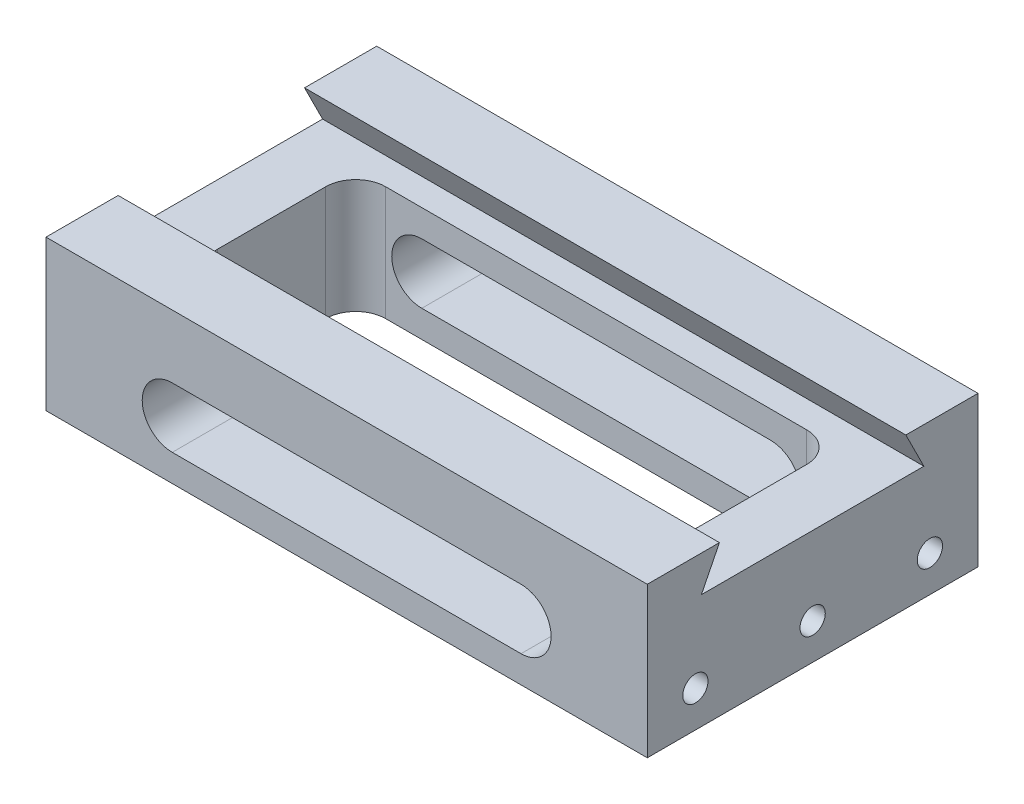
ISO-10303-21;
HEADER;
FILE_DESCRIPTION(('STEP AP214'),'2;1');
FILE_NAME('part.step','',(''),(''),'','','');
FILE_SCHEMA(('AUTOMOTIVE_DESIGN { 1 0 10303 214 1 1 1 1 }'));
ENDSEC;
DATA;
#1=APPLICATION_CONTEXT('core data for automotive mechanical design processes');
#2=APPLICATION_PROTOCOL_DEFINITION('international standard','automotive_design',2000,#1);
#3=PRODUCT_CONTEXT('',#1,'mechanical');
#4=PRODUCT('Part','Part','',(#3));
#5=PRODUCT_RELATED_PRODUCT_CATEGORY('part','',(#4));
#6=PRODUCT_DEFINITION_FORMATION('','',#4);
#7=PRODUCT_DEFINITION_CONTEXT('part definition',#1,'design');
#8=PRODUCT_DEFINITION('design','',#6,#7);
#9=PRODUCT_DEFINITION_SHAPE('','',#8);
#10=(LENGTH_UNIT() NAMED_UNIT(*) SI_UNIT(.MILLI.,.METRE.));
#11=(NAMED_UNIT(*) PLANE_ANGLE_UNIT() SI_UNIT($,.RADIAN.));
#12=(NAMED_UNIT(*) SI_UNIT($,.STERADIAN.) SOLID_ANGLE_UNIT());
#13=UNCERTAINTY_MEASURE_WITH_UNIT(LENGTH_MEASURE(1.E-05),#10,'distance_accuracy_value','');
#14=(GEOMETRIC_REPRESENTATION_CONTEXT(3) GLOBAL_UNCERTAINTY_ASSIGNED_CONTEXT((#13)) GLOBAL_UNIT_ASSIGNED_CONTEXT((#10,
#11,#12)) REPRESENTATION_CONTEXT('',''));
#15=CARTESIAN_POINT('',(0.,0.,0.));
#16=DIRECTION('',(0.,0.,1.));
#17=DIRECTION('',(1.,0.,0.));
#18=AXIS2_PLACEMENT_3D('',#15,#16,#17);
#19=CARTESIAN_POINT('',(0.,25.,0.));
#20=DIRECTION('',(0.,-1.,0.));
#21=DIRECTION('',(0.,0.,-1.));
#22=AXIS2_PLACEMENT_3D('',#19,#20,#21);
#23=PLANE('',#22);
#24=DIRECTION('',(0.,0.,1.));
#25=VECTOR('',#24,1.);
#26=CARTESIAN_POINT('',(-50.,25.,27.5));
#27=LINE('',#26,#25);
#28=CARTESIAN_POINT('',(-50.,25.,-27.5));
#29=VERTEX_POINT('',#28);
#30=CARTESIAN_POINT('',(-50.,25.,-15.5));
#31=VERTEX_POINT('',#30);
#32=EDGE_CURVE('E423',#29,#31,#27,.T.);
#33=ORIENTED_EDGE('',*,*,#32,.T.);
#34=DIRECTION('',(1.,0.,0.));
#35=VECTOR('',#34,1.);
#36=CARTESIAN_POINT('',(-50.,25.,-15.5));
#37=LINE('',#36,#35);
#38=CARTESIAN_POINT('',(50.,25.,-15.5));
#39=VERTEX_POINT('',#38);
#40=EDGE_CURVE('E338',#31,#39,#37,.T.);
#41=ORIENTED_EDGE('',*,*,#40,.T.);
#42=DIRECTION('',(0.,0.,-1.));
#43=VECTOR('',#42,1.);
#44=CARTESIAN_POINT('',(50.,25.,27.5));
#45=LINE('',#44,#43);
#46=CARTESIAN_POINT('',(50.,25.,-27.5));
#47=VERTEX_POINT('',#46);
#48=EDGE_CURVE('E420',#39,#47,#45,.T.);
#49=ORIENTED_EDGE('',*,*,#48,.T.);
#50=DIRECTION('',(-1.,0.,0.));
#51=VECTOR('',#50,1.);
#52=CARTESIAN_POINT('',(-50.,25.,-27.5));
#53=LINE('',#52,#51);
#54=EDGE_CURVE('E419',#47,#29,#53,.T.);
#55=ORIENTED_EDGE('',*,*,#54,.T.);
#56=EDGE_LOOP('',(#33,#41,#49,#55));
#57=FACE_BOUND('',#56,.T.);
#58=ADVANCED_FACE('F50',(#57),#23,.F.);
#59=CARTESIAN_POINT('',(50.,25.,27.5));
#60=DIRECTION('',(-1.,0.,0.));
#61=DIRECTION('',(0.,0.,1.));
#62=AXIS2_PLACEMENT_3D('',#59,#60,#61);
#63=PLANE('',#62);
#64=CARTESIAN_POINT('',(50.,6.,19.5));
#65=DIRECTION('',(1.,0.,0.));
#66=DIRECTION('',(0.,0.,-1.));
#67=AXIS2_PLACEMENT_3D('',#64,#65,#66);
#68=CIRCLE('',#67,2.1);
#69=CARTESIAN_POINT('',(50.,6.,17.4));
#70=VERTEX_POINT('',#69);
#71=EDGE_CURVE('E256',#70,#70,#68,.T.);
#72=ORIENTED_EDGE('',*,*,#71,.F.);
#73=EDGE_LOOP('',(#72));
#74=FACE_BOUND('',#73,.T.);
#75=CARTESIAN_POINT('',(50.,6.,0.));
#76=DIRECTION('',(1.,0.,0.));
#77=DIRECTION('',(0.,0.,-1.));
#78=AXIS2_PLACEMENT_3D('',#75,#76,#77);
#79=CIRCLE('',#78,2.1);
#80=CARTESIAN_POINT('',(50.,6.,-2.1));
#81=VERTEX_POINT('',#80);
#82=EDGE_CURVE('E262',#81,#81,#79,.T.);
#83=ORIENTED_EDGE('',*,*,#82,.F.);
#84=EDGE_LOOP('',(#83));
#85=FACE_BOUND('',#84,.T.);
#86=CARTESIAN_POINT('',(50.,6.,-19.5));
#87=DIRECTION('',(1.,0.,0.));
#88=DIRECTION('',(0.,0.,-1.));
#89=AXIS2_PLACEMENT_3D('',#86,#87,#88);
#90=CIRCLE('',#89,2.1);
#91=CARTESIAN_POINT('',(50.,6.,-21.6));
#92=VERTEX_POINT('',#91);
#93=EDGE_CURVE('E268',#92,#92,#90,.T.);
#94=ORIENTED_EDGE('',*,*,#93,.F.);
#95=EDGE_LOOP('',(#94));
#96=FACE_BOUND('',#95,.T.);
#97=ORIENTED_EDGE('',*,*,#48,.F.);
#98=DIRECTION('',(0.,0.894427190999916,0.447213595499958));
#99=VECTOR('',#98,1.);
#100=CARTESIAN_POINT('',(50.,25.,-15.5));
#101=LINE('',#100,#99);
#102=CARTESIAN_POINT('',(50.,19.,-18.5));
#103=VERTEX_POINT('',#102);
#104=EDGE_CURVE('E325',#103,#39,#101,.T.);
#105=ORIENTED_EDGE('',*,*,#104,.F.);
#106=DIRECTION('',(0.,0.,-1.));
#107=VECTOR('',#106,1.);
#108=CARTESIAN_POINT('',(50.,19.,-18.5));
#109=LINE('',#108,#107);
#110=CARTESIAN_POINT('',(50.,19.,18.5));
#111=VERTEX_POINT('',#110);
#112=EDGE_CURVE('E334',#111,#103,#109,.T.);
#113=ORIENTED_EDGE('',*,*,#112,.F.);
#114=DIRECTION('',(0.,-0.894427190999916,0.447213595499958));
#115=VECTOR('',#114,1.);
#116=CARTESIAN_POINT('',(50.,25.,15.5));
#117=LINE('',#116,#115);
#118=CARTESIAN_POINT('',(50.,25.,15.5));
#119=VERTEX_POINT('',#118);
#120=EDGE_CURVE('E320',#119,#111,#117,.T.);
#121=ORIENTED_EDGE('',*,*,#120,.F.);
#122=CARTESIAN_POINT('',(50.,25.,27.5));
#123=VERTEX_POINT('',#122);
#124=EDGE_CURVE('E416',#123,#119,#45,.T.);
#125=ORIENTED_EDGE('',*,*,#124,.F.);
#126=DIRECTION('',(0.,-1.,0.));
#127=VECTOR('',#126,1.);
#128=CARTESIAN_POINT('',(50.,25.,27.5));
#129=LINE('',#128,#127);
#130=CARTESIAN_POINT('',(50.,0.,27.5));
#131=VERTEX_POINT('',#130);
#132=EDGE_CURVE('E428',#123,#131,#129,.T.);
#133=ORIENTED_EDGE('',*,*,#132,.T.);
#134=DIRECTION('',(0.,0.,-1.));
#135=VECTOR('',#134,1.);
#136=CARTESIAN_POINT('',(50.,0.,27.5));
#137=LINE('',#136,#135);
#138=CARTESIAN_POINT('',(50.,0.,-27.5));
#139=VERTEX_POINT('',#138);
#140=EDGE_CURVE('E395',#131,#139,#137,.T.);
#141=ORIENTED_EDGE('',*,*,#140,.T.);
#142=DIRECTION('',(0.,-1.,0.));
#143=VECTOR('',#142,1.);
#144=CARTESIAN_POINT('',(50.,25.,-27.5));
#145=LINE('',#144,#143);
#146=EDGE_CURVE('E445',#47,#139,#145,.T.);
#147=ORIENTED_EDGE('',*,*,#146,.F.);
#148=EDGE_LOOP('',(#97,#105,#113,#121,#125,#133,#141,#147));
#149=FACE_BOUND('',#148,.T.);
#150=ADVANCED_FACE('F52',(#74,#85,#96,#149),#63,.F.);
#151=CARTESIAN_POINT('',(-50.,25.,-27.5));
#152=DIRECTION('',(0.,0.,1.));
#153=DIRECTION('',(1.,0.,0.));
#154=AXIS2_PLACEMENT_3D('',#151,#152,#153);
#155=PLANE('',#154);
#156=DIRECTION('',(-1.,0.,0.));
#157=VECTOR('',#156,1.);
#158=CARTESIAN_POINT('',(-29.,14.5,-27.5));
#159=LINE('',#158,#157);
#160=CARTESIAN_POINT('',(29.,14.5,-27.5));
#161=VERTEX_POINT('',#160);
#162=CARTESIAN_POINT('',(-29.,14.5,-27.5));
#163=VERTEX_POINT('',#162);
#164=EDGE_CURVE('E282',#161,#163,#159,.T.);
#165=ORIENTED_EDGE('',*,*,#164,.T.);
#166=CARTESIAN_POINT('',(-29.,9.5,-27.5));
#167=DIRECTION('',(0.,0.,1.));
#168=DIRECTION('',(1.,0.,0.));
#169=AXIS2_PLACEMENT_3D('',#166,#167,#168);
#170=CIRCLE('',#169,5.00000000000001);
#171=CARTESIAN_POINT('',(-29.,4.49999999999999,-27.5));
#172=VERTEX_POINT('',#171);
#173=EDGE_CURVE('E274',#163,#172,#170,.T.);
#174=ORIENTED_EDGE('',*,*,#173,.T.);
#175=DIRECTION('',(1.,0.,0.));
#176=VECTOR('',#175,1.);
#177=CARTESIAN_POINT('',(-29.,4.49999999999999,-27.5));
#178=LINE('',#177,#176);
#179=CARTESIAN_POINT('',(29.,4.49999999999999,-27.5));
#180=VERTEX_POINT('',#179);
#181=EDGE_CURVE('E277',#172,#180,#178,.T.);
#182=ORIENTED_EDGE('',*,*,#181,.T.);
#183=CARTESIAN_POINT('',(29.,9.50000000000001,-27.5));
#184=DIRECTION('',(0.,0.,1.));
#185=DIRECTION('',(1.,0.,0.));
#186=AXIS2_PLACEMENT_3D('',#183,#184,#185);
#187=CIRCLE('',#186,5.00000000000002);
#188=EDGE_CURVE('E65',#180,#161,#187,.T.);
#189=ORIENTED_EDGE('',*,*,#188,.T.);
#190=EDGE_LOOP('',(#165,#174,#182,#189));
#191=FACE_BOUND('',#190,.T.);
#192=DIRECTION('',(-1.,0.,0.));
#193=VECTOR('',#192,1.);
#194=CARTESIAN_POINT('',(-50.,0.,-27.5));
#195=LINE('',#194,#193);
#196=CARTESIAN_POINT('',(-50.,0.,-27.5));
#197=VERTEX_POINT('',#196);
#198=EDGE_CURVE('E431',#139,#197,#195,.T.);
#199=ORIENTED_EDGE('',*,*,#198,.T.);
#200=DIRECTION('',(0.,-1.,0.));
#201=VECTOR('',#200,1.);
#202=CARTESIAN_POINT('',(-50.,25.,-27.5));
#203=LINE('',#202,#201);
#204=EDGE_CURVE('E442',#29,#197,#203,.T.);
#205=ORIENTED_EDGE('',*,*,#204,.F.);
#206=ORIENTED_EDGE('',*,*,#54,.F.);
#207=ORIENTED_EDGE('',*,*,#146,.T.);
#208=EDGE_LOOP('',(#199,#205,#206,#207));
#209=FACE_BOUND('',#208,.T.);
#210=ADVANCED_FACE('F495',(#191,#209),#155,.F.);
#211=CARTESIAN_POINT('',(-50.,25.,27.5));
#212=DIRECTION('',(1.,0.,0.));
#213=DIRECTION('',(0.,0.,-1.));
#214=AXIS2_PLACEMENT_3D('',#211,#212,#213);
#215=PLANE('',#214);
#216=CARTESIAN_POINT('',(-50.,6.,19.5));
#217=DIRECTION('',(-1.,0.,0.));
#218=DIRECTION('',(0.,0.,1.));
#219=AXIS2_PLACEMENT_3D('',#216,#217,#218);
#220=CIRCLE('',#219,2.1);
#221=CARTESIAN_POINT('',(-50.,6.,21.6));
#222=VERTEX_POINT('',#221);
#223=EDGE_CURVE('E240',#222,#222,#220,.T.);
#224=ORIENTED_EDGE('',*,*,#223,.F.);
#225=EDGE_LOOP('',(#224));
#226=FACE_BOUND('',#225,.T.);
#227=CARTESIAN_POINT('',(-50.,6.,0.));
#228=DIRECTION('',(-1.,0.,0.));
#229=DIRECTION('',(0.,0.,1.));
#230=AXIS2_PLACEMENT_3D('',#227,#228,#229);
#231=CIRCLE('',#230,2.1);
#232=CARTESIAN_POINT('',(-50.,6.,2.1));
#233=VERTEX_POINT('',#232);
#234=EDGE_CURVE('E239',#233,#233,#231,.T.);
#235=ORIENTED_EDGE('',*,*,#234,.F.);
#236=EDGE_LOOP('',(#235));
#237=FACE_BOUND('',#236,.T.);
#238=CARTESIAN_POINT('',(-50.,6.,-19.5));
#239=DIRECTION('',(-1.,0.,0.));
#240=DIRECTION('',(0.,0.,1.));
#241=AXIS2_PLACEMENT_3D('',#238,#239,#240);
#242=CIRCLE('',#241,2.1);
#243=CARTESIAN_POINT('',(-50.,6.,-17.4));
#244=VERTEX_POINT('',#243);
#245=EDGE_CURVE('E250',#244,#244,#242,.T.);
#246=ORIENTED_EDGE('',*,*,#245,.F.);
#247=EDGE_LOOP('',(#246));
#248=FACE_BOUND('',#247,.T.);
#249=DIRECTION('',(0.,0.,-1.));
#250=VECTOR('',#249,1.);
#251=CARTESIAN_POINT('',(-50.,19.,-18.5));
#252=LINE('',#251,#250);
#253=CARTESIAN_POINT('',(-50.,19.,18.5));
#254=VERTEX_POINT('',#253);
#255=CARTESIAN_POINT('',(-50.,19.,-18.5));
#256=VERTEX_POINT('',#255);
#257=EDGE_CURVE('E324',#254,#256,#252,.T.);
#258=ORIENTED_EDGE('',*,*,#257,.T.);
#259=DIRECTION('',(0.,0.894427190999916,0.447213595499958));
#260=VECTOR('',#259,1.);
#261=CARTESIAN_POINT('',(-50.,25.,-15.5));
#262=LINE('',#261,#260);
#263=EDGE_CURVE('E328',#256,#31,#262,.T.);
#264=ORIENTED_EDGE('',*,*,#263,.T.);
#265=ORIENTED_EDGE('',*,*,#32,.F.);
#266=ORIENTED_EDGE('',*,*,#204,.T.);
#267=DIRECTION('',(0.,0.,1.));
#268=VECTOR('',#267,1.);
#269=CARTESIAN_POINT('',(-50.,0.,27.5));
#270=LINE('',#269,#268);
#271=CARTESIAN_POINT('',(-50.,0.,27.5));
#272=VERTEX_POINT('',#271);
#273=EDGE_CURVE('E433',#197,#272,#270,.T.);
#274=ORIENTED_EDGE('',*,*,#273,.T.);
#275=DIRECTION('',(0.,-1.,0.));
#276=VECTOR('',#275,1.);
#277=CARTESIAN_POINT('',(-50.,25.,27.5));
#278=LINE('',#277,#276);
#279=CARTESIAN_POINT('',(-50.,25.,27.5));
#280=VERTEX_POINT('',#279);
#281=EDGE_CURVE('E439',#280,#272,#278,.T.);
#282=ORIENTED_EDGE('',*,*,#281,.F.);
#283=CARTESIAN_POINT('',(-50.,25.,15.5));
#284=VERTEX_POINT('',#283);
#285=EDGE_CURVE('E422',#284,#280,#27,.T.);
#286=ORIENTED_EDGE('',*,*,#285,.F.);
#287=DIRECTION('',(0.,-0.894427190999916,0.447213595499958));
#288=VECTOR('',#287,1.);
#289=CARTESIAN_POINT('',(-50.,25.,15.5));
#290=LINE('',#289,#288);
#291=EDGE_CURVE('E321',#284,#254,#290,.T.);
#292=ORIENTED_EDGE('',*,*,#291,.T.);
#293=EDGE_LOOP('',(#258,#264,#265,#266,#274,#282,#286,#292));
#294=FACE_BOUND('',#293,.T.);
#295=ADVANCED_FACE('F508',(#226,#237,#248,#294),#215,.F.);
#296=CARTESIAN_POINT('',(-50.,25.,27.5));
#297=DIRECTION('',(0.,0.,-1.));
#298=DIRECTION('',(-1.,0.,0.));
#299=AXIS2_PLACEMENT_3D('',#296,#297,#298);
#300=PLANE('',#299);
#301=DIRECTION('',(1.,0.,0.));
#302=VECTOR('',#301,1.);
#303=CARTESIAN_POINT('',(-29.,4.49999999999999,27.5));
#304=LINE('',#303,#302);
#305=CARTESIAN_POINT('',(-29.,4.49999999999999,27.5));
#306=VERTEX_POINT('',#305);
#307=CARTESIAN_POINT('',(29.,4.49999999999999,27.5));
#308=VERTEX_POINT('',#307);
#309=EDGE_CURVE('E287',#306,#308,#304,.T.);
#310=ORIENTED_EDGE('',*,*,#309,.F.);
#311=CARTESIAN_POINT('',(-29.,9.5,27.5));
#312=DIRECTION('',(0.,0.,1.));
#313=DIRECTION('',(1.,0.,0.));
#314=AXIS2_PLACEMENT_3D('',#311,#312,#313);
#315=CIRCLE('',#314,5.00000000000001);
#316=CARTESIAN_POINT('',(-29.,14.5,27.5));
#317=VERTEX_POINT('',#316);
#318=EDGE_CURVE('E73',#317,#306,#315,.T.);
#319=ORIENTED_EDGE('',*,*,#318,.F.);
#320=DIRECTION('',(-1.,0.,0.));
#321=VECTOR('',#320,1.);
#322=CARTESIAN_POINT('',(-29.,14.5,27.5));
#323=LINE('',#322,#321);
#324=CARTESIAN_POINT('',(29.,14.5,27.5));
#325=VERTEX_POINT('',#324);
#326=EDGE_CURVE('E278',#325,#317,#323,.T.);
#327=ORIENTED_EDGE('',*,*,#326,.F.);
#328=CARTESIAN_POINT('',(29.,9.50000000000001,27.5));
#329=DIRECTION('',(0.,0.,1.));
#330=DIRECTION('',(1.,0.,0.));
#331=AXIS2_PLACEMENT_3D('',#328,#329,#330);
#332=CIRCLE('',#331,5.00000000000002);
#333=EDGE_CURVE('E290',#308,#325,#332,.T.);
#334=ORIENTED_EDGE('',*,*,#333,.F.);
#335=EDGE_LOOP('',(#310,#319,#327,#334));
#336=FACE_BOUND('',#335,.T.);
#337=DIRECTION('',(1.,0.,0.));
#338=VECTOR('',#337,1.);
#339=CARTESIAN_POINT('',(-50.,0.,27.5));
#340=LINE('',#339,#338);
#341=EDGE_CURVE('E435',#272,#131,#340,.T.);
#342=ORIENTED_EDGE('',*,*,#341,.T.);
#343=ORIENTED_EDGE('',*,*,#132,.F.);
#344=DIRECTION('',(1.,0.,0.));
#345=VECTOR('',#344,1.);
#346=CARTESIAN_POINT('',(-50.,25.,27.5));
#347=LINE('',#346,#345);
#348=EDGE_CURVE('E426',#280,#123,#347,.T.);
#349=ORIENTED_EDGE('',*,*,#348,.F.);
#350=ORIENTED_EDGE('',*,*,#281,.T.);
#351=EDGE_LOOP('',(#342,#343,#349,#350));
#352=FACE_BOUND('',#351,.T.);
#353=ADVANCED_FACE('F471',(#336,#352),#300,.F.);
#354=ORIENTED_EDGE('',*,*,#124,.T.);
#355=DIRECTION('',(1.,0.,0.));
#356=VECTOR('',#355,1.);
#357=CARTESIAN_POINT('',(-50.,25.,15.5));
#358=LINE('',#357,#356);
#359=EDGE_CURVE('E331',#284,#119,#358,.T.);
#360=ORIENTED_EDGE('',*,*,#359,.F.);
#361=ORIENTED_EDGE('',*,*,#285,.T.);
#362=ORIENTED_EDGE('',*,*,#348,.T.);
#363=EDGE_LOOP('',(#354,#360,#361,#362));
#364=FACE_BOUND('',#363,.T.);
#365=ADVANCED_FACE('F491',(#364),#23,.F.);
#366=CARTESIAN_POINT('',(0.,0.,0.));
#367=DIRECTION('',(0.,-1.,0.));
#368=DIRECTION('',(0.,0.,-1.));
#369=AXIS2_PLACEMENT_3D('',#366,#367,#368);
#370=PLANE('',#369);
#371=CARTESIAN_POINT('',(-35.,0.,9.));
#372=DIRECTION('',(0.,1.,0.));
#373=DIRECTION('',(0.,0.,-1.));
#374=AXIS2_PLACEMENT_3D('',#371,#372,#373);
#375=CIRCLE('',#374,5.);
#376=CARTESIAN_POINT('',(-40.,0.,8.99999999999996));
#377=VERTEX_POINT('',#376);
#378=CARTESIAN_POINT('',(-35.,0.,14.));
#379=VERTEX_POINT('',#378);
#380=EDGE_CURVE('E367',#377,#379,#375,.T.);
#381=ORIENTED_EDGE('',*,*,#380,.T.);
#382=DIRECTION('',(1.,0.,0.));
#383=VECTOR('',#382,1.);
#384=CARTESIAN_POINT('',(-35.,0.,14.));
#385=LINE('',#384,#383);
#386=CARTESIAN_POINT('',(35.,0.,14.));
#387=VERTEX_POINT('',#386);
#388=EDGE_CURVE('E370',#379,#387,#385,.T.);
#389=ORIENTED_EDGE('',*,*,#388,.T.);
#390=CARTESIAN_POINT('',(35.,0.,9.));
#391=DIRECTION('',(0.,1.,0.));
#392=DIRECTION('',(0.,0.,1.));
#393=AXIS2_PLACEMENT_3D('',#390,#391,#392);
#394=CIRCLE('',#393,5.);
#395=CARTESIAN_POINT('',(40.,0.,8.99999999999997));
#396=VERTEX_POINT('',#395);
#397=EDGE_CURVE('E373',#387,#396,#394,.T.);
#398=ORIENTED_EDGE('',*,*,#397,.T.);
#399=DIRECTION('',(0.,0.,-1.));
#400=VECTOR('',#399,1.);
#401=CARTESIAN_POINT('',(40.,0.,8.99999999999996));
#402=LINE('',#401,#400);
#403=CARTESIAN_POINT('',(40.,0.,-8.99999999999996));
#404=VERTEX_POINT('',#403);
#405=EDGE_CURVE('E376',#396,#404,#402,.T.);
#406=ORIENTED_EDGE('',*,*,#405,.T.);
#407=CARTESIAN_POINT('',(35.,0.,-9.));
#408=DIRECTION('',(0.,1.,0.));
#409=DIRECTION('',(0.,0.,-1.));
#410=AXIS2_PLACEMENT_3D('',#407,#408,#409);
#411=CIRCLE('',#410,5.);
#412=CARTESIAN_POINT('',(35.,0.,-14.));
#413=VERTEX_POINT('',#412);
#414=EDGE_CURVE('E379',#404,#413,#411,.T.);
#415=ORIENTED_EDGE('',*,*,#414,.T.);
#416=DIRECTION('',(-1.,0.,0.));
#417=VECTOR('',#416,1.);
#418=CARTESIAN_POINT('',(-35.,0.,-14.));
#419=LINE('',#418,#417);
#420=CARTESIAN_POINT('',(-35.,0.,-14.));
#421=VERTEX_POINT('',#420);
#422=EDGE_CURVE('E382',#413,#421,#419,.T.);
#423=ORIENTED_EDGE('',*,*,#422,.T.);
#424=CARTESIAN_POINT('',(-35.,0.,-9.));
#425=DIRECTION('',(0.,1.,0.));
#426=DIRECTION('',(0.,0.,-1.));
#427=AXIS2_PLACEMENT_3D('',#424,#425,#426);
#428=CIRCLE('',#427,5.);
#429=CARTESIAN_POINT('',(-40.,0.,-8.99999999999996));
#430=VERTEX_POINT('',#429);
#431=EDGE_CURVE('E385',#421,#430,#428,.T.);
#432=ORIENTED_EDGE('',*,*,#431,.T.);
#433=DIRECTION('',(0.,0.,1.));
#434=VECTOR('',#433,1.);
#435=CARTESIAN_POINT('',(-40.,0.,8.99999999999996));
#436=LINE('',#435,#434);
#437=EDGE_CURVE('E388',#430,#377,#436,.T.);
#438=ORIENTED_EDGE('',*,*,#437,.T.);
#439=EDGE_LOOP('',(#381,#389,#398,#406,#415,#423,#432,#438));
#440=FACE_BOUND('',#439,.T.);
#441=ORIENTED_EDGE('',*,*,#140,.F.);
#442=ORIENTED_EDGE('',*,*,#341,.F.);
#443=ORIENTED_EDGE('',*,*,#273,.F.);
#444=ORIENTED_EDGE('',*,*,#198,.F.);
#445=EDGE_LOOP('',(#441,#442,#443,#444));
#446=FACE_BOUND('',#445,.T.);
#447=ADVANCED_FACE('F500',(#440,#446),#370,.T.);
#448=CARTESIAN_POINT('',(-35.,0.,9.));
#449=DIRECTION('',(0.,1.,0.));
#450=DIRECTION('',(0.,0.,1.));
#451=AXIS2_PLACEMENT_3D('',#448,#449,#450);
#452=CYLINDRICAL_SURFACE('',#451,5.);
#453=DIRECTION('',(0.,1.,0.));
#454=VECTOR('',#453,1.);
#455=CARTESIAN_POINT('',(-40.,0.,8.99999999999996));
#456=LINE('',#455,#454);
#457=CARTESIAN_POINT('',(-40.,19.,8.99999999999996));
#458=VERTEX_POINT('',#457);
#459=EDGE_CURVE('E392',#377,#458,#456,.T.);
#460=ORIENTED_EDGE('',*,*,#459,.T.);
#461=CARTESIAN_POINT('',(-35.,19.,9.));
#462=DIRECTION('',(0.,-1.,0.));
#463=DIRECTION('',(0.,0.,-1.));
#464=AXIS2_PLACEMENT_3D('',#461,#462,#463);
#465=CIRCLE('',#464,5.);
#466=CARTESIAN_POINT('',(-35.,19.,14.));
#467=VERTEX_POINT('',#466);
#468=EDGE_CURVE('E364',#458,#467,#465,.F.);
#469=ORIENTED_EDGE('',*,*,#468,.T.);
#470=DIRECTION('',(0.,1.,0.));
#471=VECTOR('',#470,1.);
#472=CARTESIAN_POINT('',(-35.,0.,14.));
#473=LINE('',#472,#471);
#474=EDGE_CURVE('E391',#379,#467,#473,.T.);
#475=ORIENTED_EDGE('',*,*,#474,.F.);
#476=ORIENTED_EDGE('',*,*,#380,.F.);
#477=EDGE_LOOP('',(#460,#469,#475,#476));
#478=FACE_BOUND('',#477,.T.);
#479=ADVANCED_FACE('F506',(#478),#452,.F.);
#480=CARTESIAN_POINT('',(-40.,0.,8.99999999999996));
#481=DIRECTION('',(-1.,0.,0.));
#482=DIRECTION('',(0.,0.,1.));
#483=AXIS2_PLACEMENT_3D('',#480,#481,#482);
#484=PLANE('',#483);
#485=DIRECTION('',(0.,1.,0.));
#486=VECTOR('',#485,1.);
#487=CARTESIAN_POINT('',(-40.,0.,-8.99999999999996));
#488=LINE('',#487,#486);
#489=CARTESIAN_POINT('',(-40.,19.,-8.99999999999996));
#490=VERTEX_POINT('',#489);
#491=EDGE_CURVE('E396',#430,#490,#488,.T.);
#492=ORIENTED_EDGE('',*,*,#491,.T.);
#493=DIRECTION('',(0.,0.,1.));
#494=VECTOR('',#493,1.);
#495=CARTESIAN_POINT('',(-40.,19.,8.99999999999996));
#496=LINE('',#495,#494);
#497=EDGE_CURVE('E361',#490,#458,#496,.T.);
#498=ORIENTED_EDGE('',*,*,#497,.T.);
#499=ORIENTED_EDGE('',*,*,#459,.F.);
#500=ORIENTED_EDGE('',*,*,#437,.F.);
#501=EDGE_LOOP('',(#492,#498,#499,#500));
#502=FACE_BOUND('',#501,.T.);
#503=ADVANCED_FACE('F547',(#502),#484,.F.);
#504=CARTESIAN_POINT('',(-35.,0.,-9.));
#505=DIRECTION('',(0.,1.,0.));
#506=DIRECTION('',(0.,0.,1.));
#507=AXIS2_PLACEMENT_3D('',#504,#505,#506);
#508=CYLINDRICAL_SURFACE('',#507,5.);
#509=DIRECTION('',(0.,1.,0.));
#510=VECTOR('',#509,1.);
#511=CARTESIAN_POINT('',(-35.,0.,-14.));
#512=LINE('',#511,#510);
#513=CARTESIAN_POINT('',(-35.,19.,-14.));
#514=VERTEX_POINT('',#513);
#515=EDGE_CURVE('E399',#421,#514,#512,.T.);
#516=ORIENTED_EDGE('',*,*,#515,.T.);
#517=CARTESIAN_POINT('',(-35.,19.,-9.));
#518=DIRECTION('',(0.,-1.,0.));
#519=DIRECTION('',(0.,0.,-1.));
#520=AXIS2_PLACEMENT_3D('',#517,#518,#519);
#521=CIRCLE('',#520,5.);
#522=EDGE_CURVE('E358',#514,#490,#521,.F.);
#523=ORIENTED_EDGE('',*,*,#522,.T.);
#524=ORIENTED_EDGE('',*,*,#491,.F.);
#525=ORIENTED_EDGE('',*,*,#431,.F.);
#526=EDGE_LOOP('',(#516,#523,#524,#525));
#527=FACE_BOUND('',#526,.T.);
#528=ADVANCED_FACE('F544',(#527),#508,.F.);
#529=CARTESIAN_POINT('',(-35.,0.,-14.));
#530=DIRECTION('',(0.,0.,-1.));
#531=DIRECTION('',(-1.,0.,0.));
#532=AXIS2_PLACEMENT_3D('',#529,#530,#531);
#533=PLANE('',#532);
#534=DIRECTION('',(-1.,0.,0.));
#535=VECTOR('',#534,1.);
#536=CARTESIAN_POINT('',(-35.,4.49999999999999,-14.));
#537=LINE('',#536,#535);
#538=CARTESIAN_POINT('',(29.,4.49999999999999,-14.));
#539=VERTEX_POINT('',#538);
#540=CARTESIAN_POINT('',(-29.,4.49999999999999,-14.));
#541=VERTEX_POINT('',#540);
#542=EDGE_CURVE('E298',#539,#541,#537,.T.);
#543=ORIENTED_EDGE('',*,*,#542,.T.);
#544=CARTESIAN_POINT('',(-29.,9.5,-14.));
#545=DIRECTION('',(0.,0.,-1.));
#546=DIRECTION('',(-1.,0.,0.));
#547=AXIS2_PLACEMENT_3D('',#544,#545,#546);
#548=CIRCLE('',#547,5.00000000000001);
#549=CARTESIAN_POINT('',(-29.,14.5,-14.));
#550=VERTEX_POINT('',#549);
#551=EDGE_CURVE('E317',#541,#550,#548,.T.);
#552=ORIENTED_EDGE('',*,*,#551,.T.);
#553=DIRECTION('',(1.,0.,0.));
#554=VECTOR('',#553,1.);
#555=CARTESIAN_POINT('',(-35.,14.5,-14.));
#556=LINE('',#555,#554);
#557=CARTESIAN_POINT('',(29.,14.5,-14.));
#558=VERTEX_POINT('',#557);
#559=EDGE_CURVE('E314',#550,#558,#556,.T.);
#560=ORIENTED_EDGE('',*,*,#559,.T.);
#561=CARTESIAN_POINT('',(29.,9.50000000000001,-14.));
#562=DIRECTION('',(0.,0.,-1.));
#563=DIRECTION('',(-1.,0.,0.));
#564=AXIS2_PLACEMENT_3D('',#561,#562,#563);
#565=CIRCLE('',#564,5.00000000000002);
#566=EDGE_CURVE('E311',#558,#539,#565,.T.);
#567=ORIENTED_EDGE('',*,*,#566,.T.);
#568=EDGE_LOOP('',(#543,#552,#560,#567));
#569=FACE_BOUND('',#568,.T.);
#570=DIRECTION('',(0.,1.,0.));
#571=VECTOR('',#570,1.);
#572=CARTESIAN_POINT('',(35.,0.,-14.));
#573=LINE('',#572,#571);
#574=CARTESIAN_POINT('',(35.,19.,-14.));
#575=VERTEX_POINT('',#574);
#576=EDGE_CURVE('E402',#413,#575,#573,.T.);
#577=ORIENTED_EDGE('',*,*,#576,.T.);
#578=DIRECTION('',(-1.,0.,0.));
#579=VECTOR('',#578,1.);
#580=CARTESIAN_POINT('',(-35.,19.,-14.));
#581=LINE('',#580,#579);
#582=EDGE_CURVE('E355',#575,#514,#581,.T.);
#583=ORIENTED_EDGE('',*,*,#582,.T.);
#584=ORIENTED_EDGE('',*,*,#515,.F.);
#585=ORIENTED_EDGE('',*,*,#422,.F.);
#586=EDGE_LOOP('',(#577,#583,#584,#585));
#587=FACE_BOUND('',#586,.T.);
#588=ADVANCED_FACE('F552',(#569,#587),#533,.F.);
#589=CARTESIAN_POINT('',(35.,0.,-9.));
#590=DIRECTION('',(0.,1.,0.));
#591=DIRECTION('',(0.,0.,1.));
#592=AXIS2_PLACEMENT_3D('',#589,#590,#591);
#593=CYLINDRICAL_SURFACE('',#592,5.);
#594=DIRECTION('',(0.,1.,0.));
#595=VECTOR('',#594,1.);
#596=CARTESIAN_POINT('',(40.,0.,-8.99999999999996));
#597=LINE('',#596,#595);
#598=CARTESIAN_POINT('',(40.,19.,-8.99999999999996));
#599=VERTEX_POINT('',#598);
#600=EDGE_CURVE('E405',#404,#599,#597,.T.);
#601=ORIENTED_EDGE('',*,*,#600,.T.);
#602=CARTESIAN_POINT('',(35.,19.,-9.));
#603=DIRECTION('',(0.,-1.,0.));
#604=DIRECTION('',(0.,0.,-1.));
#605=AXIS2_PLACEMENT_3D('',#602,#603,#604);
#606=CIRCLE('',#605,5.);
#607=EDGE_CURVE('E352',#599,#575,#606,.F.);
#608=ORIENTED_EDGE('',*,*,#607,.T.);
#609=ORIENTED_EDGE('',*,*,#576,.F.);
#610=ORIENTED_EDGE('',*,*,#414,.F.);
#611=EDGE_LOOP('',(#601,#608,#609,#610));
#612=FACE_BOUND('',#611,.T.);
#613=ADVANCED_FACE('F554',(#612),#593,.F.);
#614=CARTESIAN_POINT('',(40.,0.,8.99999999999996));
#615=DIRECTION('',(1.,0.,0.));
#616=DIRECTION('',(0.,0.,-1.));
#617=AXIS2_PLACEMENT_3D('',#614,#615,#616);
#618=PLANE('',#617);
#619=DIRECTION('',(0.,1.,0.));
#620=VECTOR('',#619,1.);
#621=CARTESIAN_POINT('',(40.,0.,8.99999999999997));
#622=LINE('',#621,#620);
#623=CARTESIAN_POINT('',(40.,19.,8.99999999999997));
#624=VERTEX_POINT('',#623);
#625=EDGE_CURVE('E408',#396,#624,#622,.T.);
#626=ORIENTED_EDGE('',*,*,#625,.T.);
#627=DIRECTION('',(0.,0.,-1.));
#628=VECTOR('',#627,1.);
#629=CARTESIAN_POINT('',(40.,19.,8.99999999999996));
#630=LINE('',#629,#628);
#631=EDGE_CURVE('E349',#624,#599,#630,.T.);
#632=ORIENTED_EDGE('',*,*,#631,.T.);
#633=ORIENTED_EDGE('',*,*,#600,.F.);
#634=ORIENTED_EDGE('',*,*,#405,.F.);
#635=EDGE_LOOP('',(#626,#632,#633,#634));
#636=FACE_BOUND('',#635,.T.);
#637=ADVANCED_FACE('F557',(#636),#618,.F.);
#638=CARTESIAN_POINT('',(35.,0.,9.));
#639=DIRECTION('',(0.,1.,0.));
#640=DIRECTION('',(0.,0.,1.));
#641=AXIS2_PLACEMENT_3D('',#638,#639,#640);
#642=CYLINDRICAL_SURFACE('',#641,5.);
#643=DIRECTION('',(0.,1.,0.));
#644=VECTOR('',#643,1.);
#645=CARTESIAN_POINT('',(35.,0.,14.));
#646=LINE('',#645,#644);
#647=CARTESIAN_POINT('',(35.,19.,14.));
#648=VERTEX_POINT('',#647);
#649=EDGE_CURVE('E411',#387,#648,#646,.T.);
#650=ORIENTED_EDGE('',*,*,#649,.T.);
#651=CARTESIAN_POINT('',(35.,19.,9.));
#652=DIRECTION('',(0.,-1.,0.));
#653=DIRECTION('',(0.,0.,-1.));
#654=AXIS2_PLACEMENT_3D('',#651,#652,#653);
#655=CIRCLE('',#654,5.);
#656=EDGE_CURVE('E341',#648,#624,#655,.F.);
#657=ORIENTED_EDGE('',*,*,#656,.T.);
#658=ORIENTED_EDGE('',*,*,#625,.F.);
#659=ORIENTED_EDGE('',*,*,#397,.F.);
#660=EDGE_LOOP('',(#650,#657,#658,#659));
#661=FACE_BOUND('',#660,.T.);
#662=ADVANCED_FACE('F559',(#661),#642,.F.);
#663=CARTESIAN_POINT('',(-35.,0.,14.));
#664=DIRECTION('',(0.,0.,1.));
#665=DIRECTION('',(1.,0.,0.));
#666=AXIS2_PLACEMENT_3D('',#663,#664,#665);
#667=PLANE('',#666);
#668=DIRECTION('',(-1.,0.,0.));
#669=VECTOR('',#668,1.);
#670=CARTESIAN_POINT('',(-35.,14.5,14.));
#671=LINE('',#670,#669);
#672=CARTESIAN_POINT('',(29.,14.5,14.));
#673=VERTEX_POINT('',#672);
#674=CARTESIAN_POINT('',(-29.,14.5,14.));
#675=VERTEX_POINT('',#674);
#676=EDGE_CURVE('E58',#673,#675,#671,.T.);
#677=ORIENTED_EDGE('',*,*,#676,.T.);
#678=CARTESIAN_POINT('',(-29.,9.5,14.));
#679=DIRECTION('',(0.,0.,1.));
#680=DIRECTION('',(1.,0.,0.));
#681=AXIS2_PLACEMENT_3D('',#678,#679,#680);
#682=CIRCLE('',#681,5.00000000000001);
#683=CARTESIAN_POINT('',(-29.,4.49999999999999,14.));
#684=VERTEX_POINT('',#683);
#685=EDGE_CURVE('E13',#675,#684,#682,.T.);
#686=ORIENTED_EDGE('',*,*,#685,.T.);
#687=DIRECTION('',(1.,0.,0.));
#688=VECTOR('',#687,1.);
#689=CARTESIAN_POINT('',(-35.,4.49999999999999,14.));
#690=LINE('',#689,#688);
#691=CARTESIAN_POINT('',(29.,4.49999999999999,14.));
#692=VERTEX_POINT('',#691);
#693=EDGE_CURVE('E451',#684,#692,#690,.T.);
#694=ORIENTED_EDGE('',*,*,#693,.T.);
#695=CARTESIAN_POINT('',(29.,9.50000000000001,14.));
#696=DIRECTION('',(0.,0.,1.));
#697=DIRECTION('',(1.,0.,0.));
#698=AXIS2_PLACEMENT_3D('',#695,#696,#697);
#699=CIRCLE('',#698,5.00000000000002);
#700=EDGE_CURVE('E454',#692,#673,#699,.T.);
#701=ORIENTED_EDGE('',*,*,#700,.T.);
#702=EDGE_LOOP('',(#677,#686,#694,#701));
#703=FACE_BOUND('',#702,.T.);
#704=ORIENTED_EDGE('',*,*,#474,.T.);
#705=DIRECTION('',(1.,0.,0.));
#706=VECTOR('',#705,1.);
#707=CARTESIAN_POINT('',(-35.,19.,14.));
#708=LINE('',#707,#706);
#709=EDGE_CURVE('E448',#467,#648,#708,.T.);
#710=ORIENTED_EDGE('',*,*,#709,.T.);
#711=ORIENTED_EDGE('',*,*,#649,.F.);
#712=ORIENTED_EDGE('',*,*,#388,.F.);
#713=EDGE_LOOP('',(#704,#710,#711,#712));
#714=FACE_BOUND('',#713,.T.);
#715=ADVANCED_FACE('F458',(#703,#714),#667,.F.);
#716=CARTESIAN_POINT('',(-50.,19.,-18.5));
#717=DIRECTION('',(0.,-1.,0.));
#718=DIRECTION('',(0.,0.,-1.));
#719=AXIS2_PLACEMENT_3D('',#716,#717,#718);
#720=PLANE('',#719);
#721=ORIENTED_EDGE('',*,*,#112,.T.);
#722=DIRECTION('',(1.,0.,0.));
#723=VECTOR('',#722,1.);
#724=CARTESIAN_POINT('',(-50.,19.,-18.5));
#725=LINE('',#724,#723);
#726=EDGE_CURVE('E342',#256,#103,#725,.T.);
#727=ORIENTED_EDGE('',*,*,#726,.F.);
#728=ORIENTED_EDGE('',*,*,#257,.F.);
#729=DIRECTION('',(1.,0.,0.));
#730=VECTOR('',#729,1.);
#731=CARTESIAN_POINT('',(-50.,19.,18.5));
#732=LINE('',#731,#730);
#733=EDGE_CURVE('E344',#254,#111,#732,.T.);
#734=ORIENTED_EDGE('',*,*,#733,.T.);
#735=EDGE_LOOP('',(#721,#727,#728,#734));
#736=FACE_BOUND('',#735,.T.);
#737=ORIENTED_EDGE('',*,*,#497,.F.);
#738=ORIENTED_EDGE('',*,*,#522,.F.);
#739=ORIENTED_EDGE('',*,*,#582,.F.);
#740=ORIENTED_EDGE('',*,*,#607,.F.);
#741=ORIENTED_EDGE('',*,*,#631,.F.);
#742=ORIENTED_EDGE('',*,*,#656,.F.);
#743=ORIENTED_EDGE('',*,*,#709,.F.);
#744=ORIENTED_EDGE('',*,*,#468,.F.);
#745=EDGE_LOOP('',(#737,#738,#739,#740,#741,#742,#743,#744));
#746=FACE_BOUND('',#745,.T.);
#747=ADVANCED_FACE('F538',(#736,#746),#720,.F.);
#748=CARTESIAN_POINT('',(-50.,25.,-15.5));
#749=DIRECTION('',(0.,0.447213595499958,-0.894427190999916));
#750=DIRECTION('',(0.,0.894427190999916,0.447213595499958));
#751=AXIS2_PLACEMENT_3D('',#748,#749,#750);
#752=PLANE('',#751);
#753=ORIENTED_EDGE('',*,*,#104,.T.);
#754=ORIENTED_EDGE('',*,*,#40,.F.);
#755=ORIENTED_EDGE('',*,*,#263,.F.);
#756=ORIENTED_EDGE('',*,*,#726,.T.);
#757=EDGE_LOOP('',(#753,#754,#755,#756));
#758=FACE_BOUND('',#757,.T.);
#759=ADVANCED_FACE('F536',(#758),#752,.F.);
#760=CARTESIAN_POINT('',(-50.,25.,15.5));
#761=DIRECTION('',(0.,0.447213595499958,0.894427190999916));
#762=DIRECTION('',(0.,-0.894427190999916,0.447213595499958));
#763=AXIS2_PLACEMENT_3D('',#760,#761,#762);
#764=PLANE('',#763);
#765=ORIENTED_EDGE('',*,*,#120,.T.);
#766=ORIENTED_EDGE('',*,*,#733,.F.);
#767=ORIENTED_EDGE('',*,*,#291,.F.);
#768=ORIENTED_EDGE('',*,*,#359,.T.);
#769=EDGE_LOOP('',(#765,#766,#767,#768));
#770=FACE_BOUND('',#769,.T.);
#771=ADVANCED_FACE('F522',(#770),#764,.F.);
#772=CARTESIAN_POINT('',(-29.,4.49999999999999,-27.5));
#773=DIRECTION('',(0.,-1.,0.));
#774=DIRECTION('',(0.,0.,-1.));
#775=AXIS2_PLACEMENT_3D('',#772,#773,#774);
#776=PLANE('',#775);
#777=DIRECTION('',(0.,0.,1.));
#778=VECTOR('',#777,1.);
#779=CARTESIAN_POINT('',(-29.,4.49999999999999,-27.5));
#780=LINE('',#779,#778);
#781=EDGE_CURVE('E285',#684,#306,#780,.T.);
#782=ORIENTED_EDGE('',*,*,#781,.T.);
#783=ORIENTED_EDGE('',*,*,#309,.T.);
#784=DIRECTION('',(0.,0.,1.));
#785=VECTOR('',#784,1.);
#786=CARTESIAN_POINT('',(29.,4.49999999999999,-27.5));
#787=LINE('',#786,#785);
#788=EDGE_CURVE('E306',#692,#308,#787,.T.);
#789=ORIENTED_EDGE('',*,*,#788,.F.);
#790=ORIENTED_EDGE('',*,*,#693,.F.);
#791=EDGE_LOOP('',(#782,#783,#789,#790));
#792=FACE_BOUND('',#791,.T.);
#793=ADVANCED_FACE('F474',(#792),#776,.F.);
#794=CARTESIAN_POINT('',(29.,9.50000000000001,-27.5));
#795=DIRECTION('',(0.,0.,1.));
#796=DIRECTION('',(1.,0.,0.));
#797=AXIS2_PLACEMENT_3D('',#794,#795,#796);
#798=CYLINDRICAL_SURFACE('',#797,5.00000000000002);
#799=ORIENTED_EDGE('',*,*,#788,.T.);
#800=ORIENTED_EDGE('',*,*,#333,.T.);
#801=DIRECTION('',(0.,0.,1.));
#802=VECTOR('',#801,1.);
#803=CARTESIAN_POINT('',(29.,14.5,-27.5));
#804=LINE('',#803,#802);
#805=EDGE_CURVE('E303',#673,#325,#804,.T.);
#806=ORIENTED_EDGE('',*,*,#805,.F.);
#807=ORIENTED_EDGE('',*,*,#700,.F.);
#808=EDGE_LOOP('',(#799,#800,#806,#807));
#809=FACE_BOUND('',#808,.T.);
#810=ADVANCED_FACE('F466',(#809),#798,.F.);
#811=CARTESIAN_POINT('',(-29.,14.5,-27.5));
#812=DIRECTION('',(0.,1.,0.));
#813=DIRECTION('',(-1.,0.,0.));
#814=AXIS2_PLACEMENT_3D('',#811,#812,#813);
#815=PLANE('',#814);
#816=ORIENTED_EDGE('',*,*,#805,.T.);
#817=ORIENTED_EDGE('',*,*,#326,.T.);
#818=DIRECTION('',(0.,0.,1.));
#819=VECTOR('',#818,1.);
#820=CARTESIAN_POINT('',(-29.,14.5,-27.5));
#821=LINE('',#820,#819);
#822=EDGE_CURVE('E299',#675,#317,#821,.T.);
#823=ORIENTED_EDGE('',*,*,#822,.F.);
#824=ORIENTED_EDGE('',*,*,#676,.F.);
#825=EDGE_LOOP('',(#816,#817,#823,#824));
#826=FACE_BOUND('',#825,.T.);
#827=ADVANCED_FACE('F464',(#826),#815,.F.);
#828=CARTESIAN_POINT('',(-29.,9.5,-27.5));
#829=DIRECTION('',(0.,0.,1.));
#830=DIRECTION('',(1.,0.,0.));
#831=AXIS2_PLACEMENT_3D('',#828,#829,#830);
#832=CYLINDRICAL_SURFACE('',#831,5.00000000000001);
#833=ORIENTED_EDGE('',*,*,#822,.T.);
#834=ORIENTED_EDGE('',*,*,#318,.T.);
#835=ORIENTED_EDGE('',*,*,#781,.F.);
#836=ORIENTED_EDGE('',*,*,#685,.F.);
#837=EDGE_LOOP('',(#833,#834,#835,#836));
#838=FACE_BOUND('',#837,.T.);
#839=ADVANCED_FACE('F475',(#838),#832,.F.);
#840=EDGE_CURVE('E307',#172,#541,#780,.T.);
#841=ORIENTED_EDGE('',*,*,#840,.F.);
#842=ORIENTED_EDGE('',*,*,#173,.F.);
#843=EDGE_CURVE('E295',#163,#550,#821,.T.);
#844=ORIENTED_EDGE('',*,*,#843,.T.);
#845=ORIENTED_EDGE('',*,*,#551,.F.);
#846=EDGE_LOOP('',(#841,#842,#844,#845));
#847=FACE_BOUND('',#846,.T.);
#848=ADVANCED_FACE('F477',(#847),#832,.F.);
#849=ORIENTED_EDGE('',*,*,#843,.F.);
#850=ORIENTED_EDGE('',*,*,#164,.F.);
#851=EDGE_CURVE('E300',#161,#558,#804,.T.);
#852=ORIENTED_EDGE('',*,*,#851,.T.);
#853=ORIENTED_EDGE('',*,*,#559,.F.);
#854=EDGE_LOOP('',(#849,#850,#852,#853));
#855=FACE_BOUND('',#854,.T.);
#856=ADVANCED_FACE('F483',(#855),#815,.F.);
#857=ORIENTED_EDGE('',*,*,#851,.F.);
#858=ORIENTED_EDGE('',*,*,#188,.F.);
#859=EDGE_CURVE('E304',#180,#539,#787,.T.);
#860=ORIENTED_EDGE('',*,*,#859,.T.);
#861=ORIENTED_EDGE('',*,*,#566,.F.);
#862=EDGE_LOOP('',(#857,#858,#860,#861));
#863=FACE_BOUND('',#862,.T.);
#864=ADVANCED_FACE('F606',(#863),#798,.F.);
#865=ORIENTED_EDGE('',*,*,#859,.F.);
#866=ORIENTED_EDGE('',*,*,#181,.F.);
#867=ORIENTED_EDGE('',*,*,#840,.T.);
#868=ORIENTED_EDGE('',*,*,#542,.F.);
#869=EDGE_LOOP('',(#865,#866,#867,#868));
#870=FACE_BOUND('',#869,.T.);
#871=ADVANCED_FACE('F599',(#870),#776,.F.);
#872=CARTESIAN_POINT('',(42.5,6.,-19.5));
#873=DIRECTION('',(1.,0.,0.));
#874=DIRECTION('',(0.,0.,-1.));
#875=AXIS2_PLACEMENT_3D('',#872,#873,#874);
#876=CONICAL_SURFACE('',#875,2.1,1.02974425867665);
#877=CARTESIAN_POINT('',(41.2381927000421,6.,-19.5));
#878=VERTEX_POINT('',#877);
#879=VERTEX_LOOP('',#878);
#880=FACE_BOUND('',#879,.T.);
#881=CARTESIAN_POINT('',(42.5,6.,-19.5));
#882=DIRECTION('',(1.,0.,0.));
#883=DIRECTION('',(0.,0.,-1.));
#884=AXIS2_PLACEMENT_3D('',#881,#882,#883);
#885=CIRCLE('',#884,2.1);
#886=CARTESIAN_POINT('',(42.5,6.,-21.6));
#887=VERTEX_POINT('',#886);
#888=EDGE_CURVE('E271',#887,#887,#885,.T.);
#889=ORIENTED_EDGE('',*,*,#888,.T.);
#890=EDGE_LOOP('',(#889));
#891=FACE_BOUND('',#890,.T.);
#892=ADVANCED_FACE('F645',(#880,#891),#876,.F.);
#893=CARTESIAN_POINT('',(50.,6.,-19.5));
#894=DIRECTION('',(1.,0.,0.));
#895=DIRECTION('',(0.,0.,-1.));
#896=AXIS2_PLACEMENT_3D('',#893,#894,#895);
#897=CYLINDRICAL_SURFACE('',#896,2.1);
#898=ORIENTED_EDGE('',*,*,#888,.F.);
#899=EDGE_LOOP('',(#898));
#900=FACE_BOUND('',#899,.T.);
#901=ORIENTED_EDGE('',*,*,#93,.T.);
#902=EDGE_LOOP('',(#901));
#903=FACE_BOUND('',#902,.T.);
#904=ADVANCED_FACE('F665',(#900,#903),#897,.F.);
#905=CARTESIAN_POINT('',(42.5,6.,0.));
#906=DIRECTION('',(1.,0.,0.));
#907=DIRECTION('',(0.,0.,-1.));
#908=AXIS2_PLACEMENT_3D('',#905,#906,#907);
#909=CONICAL_SURFACE('',#908,2.1,1.02974425867665);
#910=CARTESIAN_POINT('',(41.2381927000421,6.,0.));
#911=VERTEX_POINT('',#910);
#912=VERTEX_LOOP('',#911);
#913=FACE_BOUND('',#912,.T.);
#914=CARTESIAN_POINT('',(42.5,6.,0.));
#915=DIRECTION('',(1.,0.,0.));
#916=DIRECTION('',(0.,0.,-1.));
#917=AXIS2_PLACEMENT_3D('',#914,#915,#916);
#918=CIRCLE('',#917,2.1);
#919=CARTESIAN_POINT('',(42.5,6.,-2.1));
#920=VERTEX_POINT('',#919);
#921=EDGE_CURVE('E265',#920,#920,#918,.T.);
#922=ORIENTED_EDGE('',*,*,#921,.T.);
#923=EDGE_LOOP('',(#922));
#924=FACE_BOUND('',#923,.T.);
#925=ADVANCED_FACE('F676',(#913,#924),#909,.F.);
#926=CARTESIAN_POINT('',(50.,6.,0.));
#927=DIRECTION('',(1.,0.,0.));
#928=DIRECTION('',(0.,0.,-1.));
#929=AXIS2_PLACEMENT_3D('',#926,#927,#928);
#930=CYLINDRICAL_SURFACE('',#929,2.1);
#931=ORIENTED_EDGE('',*,*,#921,.F.);
#932=EDGE_LOOP('',(#931));
#933=FACE_BOUND('',#932,.T.);
#934=ORIENTED_EDGE('',*,*,#82,.T.);
#935=EDGE_LOOP('',(#934));
#936=FACE_BOUND('',#935,.T.);
#937=ADVANCED_FACE('F687',(#933,#936),#930,.F.);
#938=CARTESIAN_POINT('',(42.5,6.,19.5));
#939=DIRECTION('',(1.,0.,0.));
#940=DIRECTION('',(0.,0.,-1.));
#941=AXIS2_PLACEMENT_3D('',#938,#939,#940);
#942=CONICAL_SURFACE('',#941,2.1,1.02974425867665);
#943=CARTESIAN_POINT('',(41.2381927000421,6.,19.5));
#944=VERTEX_POINT('',#943);
#945=VERTEX_LOOP('',#944);
#946=FACE_BOUND('',#945,.T.);
#947=CARTESIAN_POINT('',(42.5,6.,19.5));
#948=DIRECTION('',(1.,0.,0.));
#949=DIRECTION('',(0.,0.,-1.));
#950=AXIS2_PLACEMENT_3D('',#947,#948,#949);
#951=CIRCLE('',#950,2.1);
#952=CARTESIAN_POINT('',(42.5,6.,17.4));
#953=VERTEX_POINT('',#952);
#954=EDGE_CURVE('E259',#953,#953,#951,.T.);
#955=ORIENTED_EDGE('',*,*,#954,.T.);
#956=EDGE_LOOP('',(#955));
#957=FACE_BOUND('',#956,.T.);
#958=ADVANCED_FACE('F697',(#946,#957),#942,.F.);
#959=CARTESIAN_POINT('',(50.,6.,19.5));
#960=DIRECTION('',(1.,0.,0.));
#961=DIRECTION('',(0.,0.,-1.));
#962=AXIS2_PLACEMENT_3D('',#959,#960,#961);
#963=CYLINDRICAL_SURFACE('',#962,2.1);
#964=ORIENTED_EDGE('',*,*,#954,.F.);
#965=EDGE_LOOP('',(#964));
#966=FACE_BOUND('',#965,.T.);
#967=ORIENTED_EDGE('',*,*,#71,.T.);
#968=EDGE_LOOP('',(#967));
#969=FACE_BOUND('',#968,.T.);
#970=ADVANCED_FACE('F708',(#966,#969),#963,.F.);
#971=CARTESIAN_POINT('',(-42.5,6.,-19.5));
#972=DIRECTION('',(-1.,0.,0.));
#973=DIRECTION('',(0.,0.,1.));
#974=AXIS2_PLACEMENT_3D('',#971,#972,#973);
#975=CONICAL_SURFACE('',#974,2.1,1.02974425867665);
#976=CARTESIAN_POINT('',(-41.2381927000421,6.,-19.5));
#977=VERTEX_POINT('',#976);
#978=VERTEX_LOOP('',#977);
#979=FACE_BOUND('',#978,.T.);
#980=CARTESIAN_POINT('',(-42.5,6.,-19.5));
#981=DIRECTION('',(-1.,0.,0.));
#982=DIRECTION('',(0.,0.,1.));
#983=AXIS2_PLACEMENT_3D('',#980,#981,#982);
#984=CIRCLE('',#983,2.1);
#985=CARTESIAN_POINT('',(-42.5,6.,-17.4));
#986=VERTEX_POINT('',#985);
#987=EDGE_CURVE('E253',#986,#986,#984,.T.);
#988=ORIENTED_EDGE('',*,*,#987,.T.);
#989=EDGE_LOOP('',(#988));
#990=FACE_BOUND('',#989,.T.);
#991=ADVANCED_FACE('F718',(#979,#990),#975,.F.);
#992=CARTESIAN_POINT('',(-50.,6.,-19.5));
#993=DIRECTION('',(-1.,0.,0.));
#994=DIRECTION('',(0.,0.,1.));
#995=AXIS2_PLACEMENT_3D('',#992,#993,#994);
#996=CYLINDRICAL_SURFACE('',#995,2.1);
#997=ORIENTED_EDGE('',*,*,#987,.F.);
#998=EDGE_LOOP('',(#997));
#999=FACE_BOUND('',#998,.T.);
#1000=ORIENTED_EDGE('',*,*,#245,.T.);
#1001=EDGE_LOOP('',(#1000));
#1002=FACE_BOUND('',#1001,.T.);
#1003=ADVANCED_FACE('F740',(#999,#1002),#996,.F.);
#1004=CARTESIAN_POINT('',(-42.5,6.,0.));
#1005=DIRECTION('',(-1.,0.,0.));
#1006=DIRECTION('',(0.,0.,1.));
#1007=AXIS2_PLACEMENT_3D('',#1004,#1005,#1006);
#1008=CONICAL_SURFACE('',#1007,2.1,1.02974425867665);
#1009=CARTESIAN_POINT('',(-41.2381927000421,6.,0.));
#1010=VERTEX_POINT('',#1009);
#1011=VERTEX_LOOP('',#1010);
#1012=FACE_BOUND('',#1011,.T.);
#1013=CARTESIAN_POINT('',(-42.5,6.,0.));
#1014=DIRECTION('',(-1.,0.,0.));
#1015=DIRECTION('',(0.,0.,1.));
#1016=AXIS2_PLACEMENT_3D('',#1013,#1014,#1015);
#1017=CIRCLE('',#1016,2.1);
#1018=CARTESIAN_POINT('',(-42.5,6.,2.1));
#1019=VERTEX_POINT('',#1018);
#1020=EDGE_CURVE('E243',#1019,#1019,#1017,.T.);
#1021=ORIENTED_EDGE('',*,*,#1020,.T.);
#1022=EDGE_LOOP('',(#1021));
#1023=FACE_BOUND('',#1022,.T.);
#1024=ADVANCED_FACE('F751',(#1012,#1023),#1008,.F.);
#1025=CARTESIAN_POINT('',(-50.,6.,0.));
#1026=DIRECTION('',(-1.,0.,0.));
#1027=DIRECTION('',(0.,0.,1.));
#1028=AXIS2_PLACEMENT_3D('',#1025,#1026,#1027);
#1029=CYLINDRICAL_SURFACE('',#1028,2.1);
#1030=ORIENTED_EDGE('',*,*,#1020,.F.);
#1031=EDGE_LOOP('',(#1030));
#1032=FACE_BOUND('',#1031,.T.);
#1033=ORIENTED_EDGE('',*,*,#234,.T.);
#1034=EDGE_LOOP('',(#1033));
#1035=FACE_BOUND('',#1034,.T.);
#1036=ADVANCED_FACE('F233',(#1032,#1035),#1029,.F.);
#1037=CARTESIAN_POINT('',(-42.5,6.,19.5));
#1038=DIRECTION('',(-1.,0.,0.));
#1039=DIRECTION('',(0.,0.,1.));
#1040=AXIS2_PLACEMENT_3D('',#1037,#1038,#1039);
#1041=CONICAL_SURFACE('',#1040,2.1,1.02974425867665);
#1042=CARTESIAN_POINT('',(-41.2381927000421,6.,19.5));
#1043=VERTEX_POINT('',#1042);
#1044=VERTEX_LOOP('',#1043);
#1045=FACE_BOUND('',#1044,.T.);
#1046=CARTESIAN_POINT('',(-42.5,6.,19.5));
#1047=DIRECTION('',(-1.,0.,0.));
#1048=DIRECTION('',(0.,0.,1.));
#1049=AXIS2_PLACEMENT_3D('',#1046,#1047,#1048);
#1050=CIRCLE('',#1049,2.1);
#1051=CARTESIAN_POINT('',(-42.5,6.,21.6));
#1052=VERTEX_POINT('',#1051);
#1053=EDGE_CURVE('E237',#1052,#1052,#1050,.T.);
#1054=ORIENTED_EDGE('',*,*,#1053,.T.);
#1055=EDGE_LOOP('',(#1054));
#1056=FACE_BOUND('',#1055,.T.);
#1057=ADVANCED_FACE('F229',(#1045,#1056),#1041,.F.);
#1058=CARTESIAN_POINT('',(-50.,6.,19.5));
#1059=DIRECTION('',(-1.,0.,0.));
#1060=DIRECTION('',(0.,0.,1.));
#1061=AXIS2_PLACEMENT_3D('',#1058,#1059,#1060);
#1062=CYLINDRICAL_SURFACE('',#1061,2.1);
#1063=ORIENTED_EDGE('',*,*,#1053,.F.);
#1064=EDGE_LOOP('',(#1063));
#1065=FACE_BOUND('',#1064,.T.);
#1066=ORIENTED_EDGE('',*,*,#223,.T.);
#1067=EDGE_LOOP('',(#1066));
#1068=FACE_BOUND('',#1067,.T.);
#1069=ADVANCED_FACE('F232',(#1065,#1068),#1062,.F.);
#1070=CLOSED_SHELL('',(#58,#150,#210,#295,#353,#365,#447,#479,#503,#528,#588,#613,#637,#662,
#715,#747,#759,#771,#793,#810,#827,#839,#848,#856,#864,#871,#892,#904,#925,#937,#958,#970,#991,
#1003,#1024,#1036,#1057,#1069));
#1071=MANIFOLD_SOLID_BREP('B2',#1070);
#1072=ADVANCED_BREP_SHAPE_REPRESENTATION('',(#18,#1071),#14);
#1073=SHAPE_DEFINITION_REPRESENTATION(#9,#1072);
ENDSEC;
END-ISO-10303-21;
